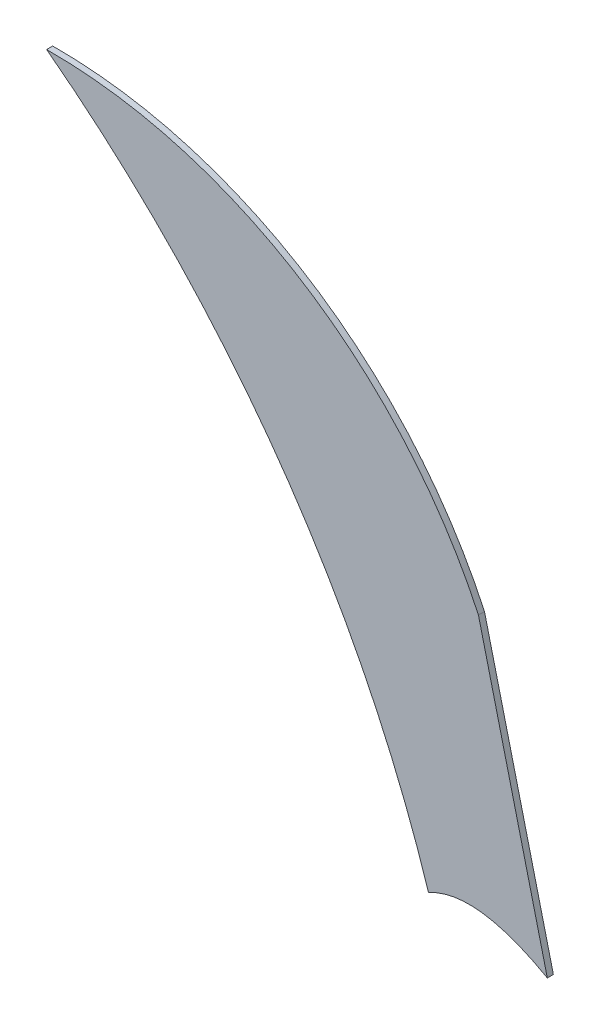
ISO-10303-21;
HEADER;
FILE_DESCRIPTION(('STEP AP214'),'2;1');
FILE_NAME('part.step','',(''),(''),'','','');
FILE_SCHEMA(('AUTOMOTIVE_DESIGN { 1 0 10303 214 1 1 1 1 }'));
ENDSEC;
DATA;
#1=APPLICATION_CONTEXT('core data for automotive mechanical design processes');
#2=APPLICATION_PROTOCOL_DEFINITION('international standard','automotive_design',2000,#1);
#3=PRODUCT_CONTEXT('',#1,'mechanical');
#4=PRODUCT('Part','Part','',(#3));
#5=PRODUCT_RELATED_PRODUCT_CATEGORY('part','',(#4));
#6=PRODUCT_DEFINITION_FORMATION('','',#4);
#7=PRODUCT_DEFINITION_CONTEXT('part definition',#1,'design');
#8=PRODUCT_DEFINITION('design','',#6,#7);
#9=PRODUCT_DEFINITION_SHAPE('','',#8);
#10=(LENGTH_UNIT() NAMED_UNIT(*) SI_UNIT(.MILLI.,.METRE.));
#11=(NAMED_UNIT(*) PLANE_ANGLE_UNIT() SI_UNIT($,.RADIAN.));
#12=(NAMED_UNIT(*) SI_UNIT($,.STERADIAN.) SOLID_ANGLE_UNIT());
#13=UNCERTAINTY_MEASURE_WITH_UNIT(LENGTH_MEASURE(1.E-05),#10,'distance_accuracy_value','');
#14=(GEOMETRIC_REPRESENTATION_CONTEXT(3) GLOBAL_UNCERTAINTY_ASSIGNED_CONTEXT((#13)) GLOBAL_UNIT_ASSIGNED_CONTEXT((#10,
#11,#12)) REPRESENTATION_CONTEXT('',''));
#15=CARTESIAN_POINT('',(0.,0.,0.));
#16=DIRECTION('',(0.,0.,1.));
#17=DIRECTION('',(1.,0.,0.));
#18=AXIS2_PLACEMENT_3D('',#15,#16,#17);
#19=CARTESIAN_POINT('',(39.0498823104945,16.6825581914405,0.1));
#20=DIRECTION('',(-0.971006446498382,-0.239053301291959,0.));
#21=DIRECTION('',(0.239053301291959,-0.971006446498382,0.));
#22=AXIS2_PLACEMENT_3D('',#19,#20,#21);
#23=PLANE('',#22);
#24=CARTESIAN_POINT('',(39.0498823104945,16.6825581914405,0.));
#25=CARTESIAN_POINT('',(38.4806464034325,18.9947276212218,0.));
#26=CARTESIAN_POINT('',(37.9114104963705,21.306897051003,0.));
#27=B_SPLINE_CURVE_WITH_KNOTS('',2,(#24,#25,#26),.UNSPECIFIED.,.F.,.F.,(3,3),(0.,1.),.UNSPECIFIED.);
#28=CARTESIAN_POINT('',(39.0498823104945,16.6825581914405,0.));
#29=VERTEX_POINT('',#28);
#30=CARTESIAN_POINT('',(37.9114104963705,21.306897051003,0.));
#31=VERTEX_POINT('',#30);
#32=EDGE_CURVE('E99',#29,#31,#27,.T.);
#33=ORIENTED_EDGE('',*,*,#32,.T.);
#34=DIRECTION('',(0.,0.,-1.));
#35=VECTOR('',#34,1.);
#36=CARTESIAN_POINT('',(37.9114104963705,21.306897051003,0.1));
#37=LINE('',#36,#35);
#38=CARTESIAN_POINT('',(37.9114104963705,21.306897051003,0.1));
#39=VERTEX_POINT('',#38);
#40=EDGE_CURVE('E11',#39,#31,#37,.T.);
#41=ORIENTED_EDGE('',*,*,#40,.F.);
#42=CARTESIAN_POINT('',(39.0498823104945,16.6825581914405,0.1));
#43=CARTESIAN_POINT('',(38.4806464034325,18.9947276212218,0.1));
#44=CARTESIAN_POINT('',(37.9114104963705,21.306897051003,0.1));
#45=B_SPLINE_CURVE_WITH_KNOTS('',2,(#42,#43,#44),.UNSPECIFIED.,.F.,.F.,(3,3),(0.,1.),.UNSPECIFIED.);
#46=CARTESIAN_POINT('',(39.0498823104945,16.6825581914405,0.1));
#47=VERTEX_POINT('',#46);
#48=EDGE_CURVE('E84',#47,#39,#45,.T.);
#49=ORIENTED_EDGE('',*,*,#48,.F.);
#50=DIRECTION('',(0.,0.,-1.));
#51=VECTOR('',#50,1.);
#52=CARTESIAN_POINT('',(39.0498823104945,16.6825581914405,0.1));
#53=LINE('',#52,#51);
#54=EDGE_CURVE('E92',#47,#29,#53,.T.);
#55=ORIENTED_EDGE('',*,*,#54,.T.);
#56=EDGE_LOOP('',(#33,#41,#49,#55));
#57=FACE_BOUND('',#56,.T.);
#58=ADVANCED_FACE('F33',(#57),#23,.F.);
#59=CARTESIAN_POINT('',(30.8244057805304,18.0179052308488,0.1));
#60=DIRECTION('',(0.,0.,-1.));
#61=DIRECTION('',(-1.,0.,0.));
#62=AXIS2_PLACEMENT_3D('',#59,#60,#61);
#63=CYLINDRICAL_SURFACE('',#62,7.81300857771069);
#64=CARTESIAN_POINT('',(30.8244057805304,18.0179052308488,0.));
#65=DIRECTION('',(0.,0.,1.));
#66=DIRECTION('',(1.,0.,0.));
#67=AXIS2_PLACEMENT_3D('',#64,#65,#66);
#68=CIRCLE('',#67,7.81300857771069);
#69=CARTESIAN_POINT('',(30.7774456895055,25.8307726804624,0.));
#70=VERTEX_POINT('',#69);
#71=EDGE_CURVE('E88',#31,#70,#68,.T.);
#72=ORIENTED_EDGE('',*,*,#71,.T.);
#73=DIRECTION('',(0.,0.,-1.));
#74=VECTOR('',#73,1.);
#75=CARTESIAN_POINT('',(30.7774456895055,25.8307726804624,0.1));
#76=LINE('',#75,#74);
#77=CARTESIAN_POINT('',(30.7774456895055,25.8307726804624,0.1));
#78=VERTEX_POINT('',#77);
#79=EDGE_CURVE('E41',#78,#70,#76,.T.);
#80=ORIENTED_EDGE('',*,*,#79,.F.);
#81=CARTESIAN_POINT('',(30.8244057805304,18.0179052308488,0.1));
#82=DIRECTION('',(0.,0.,1.));
#83=DIRECTION('',(1.,0.,0.));
#84=AXIS2_PLACEMENT_3D('',#81,#82,#83);
#85=CIRCLE('',#84,7.81300857771069);
#86=EDGE_CURVE('E79',#39,#78,#85,.T.);
#87=ORIENTED_EDGE('',*,*,#86,.F.);
#88=ORIENTED_EDGE('',*,*,#40,.T.);
#89=EDGE_LOOP('',(#72,#80,#87,#88));
#90=FACE_BOUND('',#89,.T.);
#91=ADVANCED_FACE('F87',(#90),#63,.T.);
#92=CARTESIAN_POINT('',(19.8861579082924,11.4287327404532,0.1));
#93=DIRECTION('',(0.,0.,-1.));
#94=DIRECTION('',(-1.,0.,0.));
#95=AXIS2_PLACEMENT_3D('',#92,#93,#94);
#96=CYLINDRICAL_SURFACE('',#95,18.0565473988473);
#97=CARTESIAN_POINT('',(19.8861579082924,11.4287327404532,0.));
#98=DIRECTION('',(0.,0.,-1.));
#99=DIRECTION('',(1.,0.,0.));
#100=AXIS2_PLACEMENT_3D('',#97,#98,#99);
#101=CIRCLE('',#100,18.0565473988473);
#102=CARTESIAN_POINT('',(37.086298445237,16.9236457949225,0.));
#103=VERTEX_POINT('',#102);
#104=EDGE_CURVE('E66',#70,#103,#101,.T.);
#105=ORIENTED_EDGE('',*,*,#104,.T.);
#106=DIRECTION('',(0.,0.,-1.));
#107=VECTOR('',#106,1.);
#108=CARTESIAN_POINT('',(37.086298445237,16.9236457949225,0.1));
#109=LINE('',#108,#107);
#110=CARTESIAN_POINT('',(37.086298445237,16.9236457949225,0.1));
#111=VERTEX_POINT('',#110);
#112=EDGE_CURVE('E89',#111,#103,#109,.T.);
#113=ORIENTED_EDGE('',*,*,#112,.F.);
#114=CARTESIAN_POINT('',(19.8861579082924,11.4287327404532,0.1));
#115=DIRECTION('',(0.,0.,-1.));
#116=DIRECTION('',(1.,0.,0.));
#117=AXIS2_PLACEMENT_3D('',#114,#115,#116);
#118=CIRCLE('',#117,18.0565473988473);
#119=EDGE_CURVE('E82',#78,#111,#118,.T.);
#120=ORIENTED_EDGE('',*,*,#119,.F.);
#121=ORIENTED_EDGE('',*,*,#79,.T.);
#122=EDGE_LOOP('',(#105,#113,#120,#121));
#123=FACE_BOUND('',#122,.T.);
#124=ADVANCED_FACE('F90',(#123),#96,.F.);
#125=CARTESIAN_POINT('',(37.086298445237,16.9236457949225,0.1));
#126=CARTESIAN_POINT('',(37.8662282904503,17.3519622185485,0.1));
#127=CARTESIAN_POINT('',(39.0498823104945,16.6825581914405,0.1));
#128=B_SPLINE_CURVE_WITH_KNOTS('',2,(#125,#126,#127),.UNSPECIFIED.,.F.,.F.,(3,3),(1.,
1.51762909424529),.UNSPECIFIED.);
#129=DIRECTION('',(0.,0.,-1.));
#130=VECTOR('',#129,1.);
#131=SURFACE_OF_LINEAR_EXTRUSION('',#128,#130);
#132=CARTESIAN_POINT('',(37.086298445237,16.9236457949225,0.));
#133=CARTESIAN_POINT('',(37.8662282904503,17.3519622185485,0.));
#134=CARTESIAN_POINT('',(39.0498823104945,16.6825581914405,0.));
#135=B_SPLINE_CURVE_WITH_KNOTS('',2,(#132,#133,#134),.UNSPECIFIED.,.F.,.F.,(3,3),(1.,
1.51762909424529),.UNSPECIFIED.);
#136=EDGE_CURVE('E72',#103,#29,#135,.T.);
#137=ORIENTED_EDGE('',*,*,#136,.T.);
#138=ORIENTED_EDGE('',*,*,#54,.F.);
#139=EDGE_CURVE('E49',#111,#47,#128,.T.);
#140=ORIENTED_EDGE('',*,*,#139,.F.);
#141=ORIENTED_EDGE('',*,*,#112,.T.);
#142=EDGE_LOOP('',(#137,#138,#140,#141));
#143=FACE_BOUND('',#142,.T.);
#144=ADVANCED_FACE('F107',(#143),#131,.F.);
#145=CARTESIAN_POINT('',(37.967159334158,17.077532105865,0.1));
#146=DIRECTION('',(0.,0.,-1.));
#147=DIRECTION('',(-1.,0.,0.));
#148=AXIS2_PLACEMENT_3D('',#145,#146,#147);
#149=PLANE('',#148);
#150=ORIENTED_EDGE('',*,*,#48,.T.);
#151=ORIENTED_EDGE('',*,*,#86,.T.);
#152=ORIENTED_EDGE('',*,*,#119,.T.);
#153=ORIENTED_EDGE('',*,*,#139,.T.);
#154=EDGE_LOOP('',(#150,#151,#152,#153));
#155=FACE_BOUND('',#154,.T.);
#156=ADVANCED_FACE('F80',(#155),#149,.F.);
#157=CARTESIAN_POINT('',(37.967159334158,17.077532105865,0.));
#158=DIRECTION('',(0.,0.,-1.));
#159=DIRECTION('',(-1.,0.,0.));
#160=AXIS2_PLACEMENT_3D('',#157,#158,#159);
#161=PLANE('',#160);
#162=ORIENTED_EDGE('',*,*,#32,.F.);
#163=ORIENTED_EDGE('',*,*,#136,.F.);
#164=ORIENTED_EDGE('',*,*,#104,.F.);
#165=ORIENTED_EDGE('',*,*,#71,.F.);
#166=EDGE_LOOP('',(#162,#163,#164,#165));
#167=FACE_BOUND('',#166,.T.);
#168=ADVANCED_FACE('F111',(#167),#161,.T.);
#169=CLOSED_SHELL('',(#58,#91,#124,#144,#156,#168));
#170=MANIFOLD_SOLID_BREP('B2',#169);
#171=ADVANCED_BREP_SHAPE_REPRESENTATION('',(#18,#170),#14);
#172=SHAPE_DEFINITION_REPRESENTATION(#9,#171);
ENDSEC;
END-ISO-10303-21;
